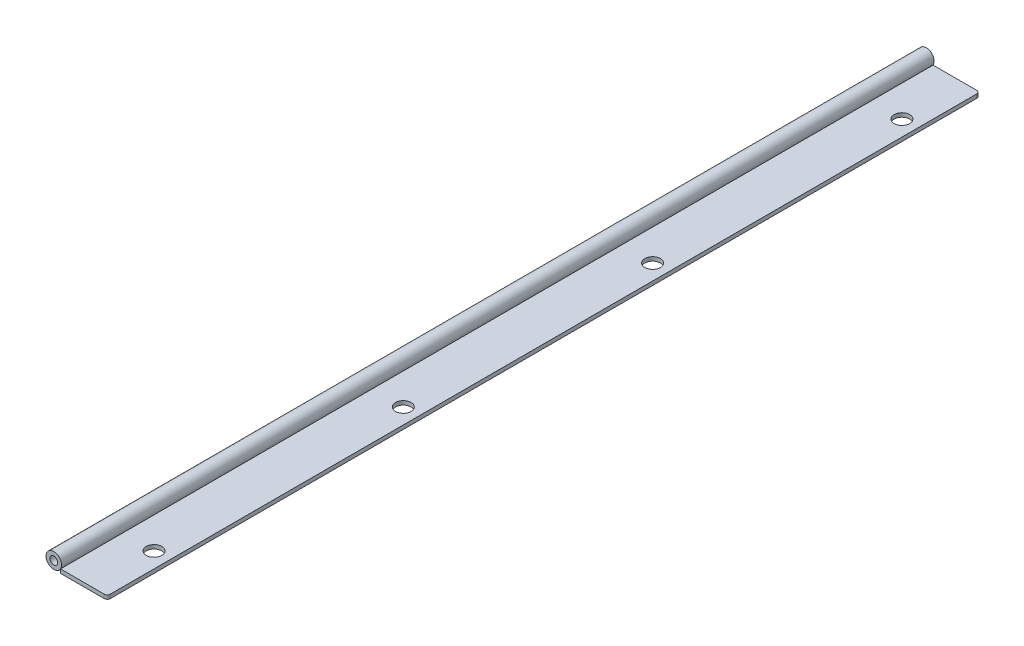
ISO-10303-21;
HEADER;
FILE_DESCRIPTION(('STEP AP214'),'2;1');
FILE_NAME('part.step','',(''),(''),'','','');
FILE_SCHEMA(('AUTOMOTIVE_DESIGN { 1 0 10303 214 1 1 1 1 }'));
ENDSEC;
DATA;
#1=APPLICATION_CONTEXT('core data for automotive mechanical design processes');
#2=APPLICATION_PROTOCOL_DEFINITION('international standard','automotive_design',2000,#1);
#3=PRODUCT_CONTEXT('',#1,'mechanical');
#4=PRODUCT('Part','Part','',(#3));
#5=PRODUCT_RELATED_PRODUCT_CATEGORY('part','',(#4));
#6=PRODUCT_DEFINITION_FORMATION('','',#4);
#7=PRODUCT_DEFINITION_CONTEXT('part definition',#1,'design');
#8=PRODUCT_DEFINITION('design','',#6,#7);
#9=PRODUCT_DEFINITION_SHAPE('','',#8);
#10=(LENGTH_UNIT() NAMED_UNIT(*) SI_UNIT(.MILLI.,.METRE.));
#11=(NAMED_UNIT(*) PLANE_ANGLE_UNIT() SI_UNIT($,.RADIAN.));
#12=(NAMED_UNIT(*) SI_UNIT($,.STERADIAN.) SOLID_ANGLE_UNIT());
#13=UNCERTAINTY_MEASURE_WITH_UNIT(LENGTH_MEASURE(1.E-05),#10,'distance_accuracy_value','');
#14=(GEOMETRIC_REPRESENTATION_CONTEXT(3) GLOBAL_UNCERTAINTY_ASSIGNED_CONTEXT((#13)) GLOBAL_UNIT_ASSIGNED_CONTEXT((#10,
#11,#12)) REPRESENTATION_CONTEXT('',''));
#15=CARTESIAN_POINT('',(0.,0.,0.));
#16=DIRECTION('',(0.,0.,1.));
#17=DIRECTION('',(1.,0.,0.));
#18=AXIS2_PLACEMENT_3D('',#15,#16,#17);
#19=CARTESIAN_POINT('',(-5.49926131403118,6.35,-711.2));
#20=DIRECTION('',(0.,0.,1.));
#21=DIRECTION('',(1.,0.,0.));
#22=AXIS2_PLACEMENT_3D('',#19,#20,#21);
#23=CYLINDRICAL_SURFACE('',#22,6.35);
#24=CARTESIAN_POINT('',(-5.49926131403118,6.35,-711.2));
#25=DIRECTION('',(0.,0.,1.));
#26=DIRECTION('',(1.,0.,0.));
#27=AXIS2_PLACEMENT_3D('',#24,#25,#26);
#28=CIRCLE('',#27,6.35);
#29=CARTESIAN_POINT('',(0.850738685968815,6.35,-711.2));
#30=VERTEX_POINT('',#29);
#31=EDGE_CURVE('E11',#30,#30,#28,.T.);
#32=ORIENTED_EDGE('',*,*,#31,.T.);
#33=EDGE_LOOP('',(#32));
#34=FACE_BOUND('',#33,.T.);
#35=CARTESIAN_POINT('',(-5.49926131403118,6.35,0.));
#36=DIRECTION('',(0.,0.,1.));
#37=DIRECTION('',(1.,0.,0.));
#38=AXIS2_PLACEMENT_3D('',#35,#36,#37);
#39=CIRCLE('',#38,6.35);
#40=CARTESIAN_POINT('',(0.850738685968815,6.35,0.));
#41=VERTEX_POINT('',#40);
#42=EDGE_CURVE('E46',#41,#41,#39,.T.);
#43=ORIENTED_EDGE('',*,*,#42,.F.);
#44=EDGE_LOOP('',(#43));
#45=FACE_BOUND('',#44,.T.);
#46=ADVANCED_FACE('F43',(#34,#45),#23,.T.);
#47=CARTESIAN_POINT('',(-5.49926131403118,6.35,-711.2));
#48=DIRECTION('',(0.,0.,1.));
#49=DIRECTION('',(1.,0.,0.));
#50=AXIS2_PLACEMENT_3D('',#47,#48,#49);
#51=PLANE('',#50);
#52=CARTESIAN_POINT('',(-5.49926131403118,6.35,-711.2));
#53=DIRECTION('',(0.,0.,1.));
#54=DIRECTION('',(1.,0.,0.));
#55=AXIS2_PLACEMENT_3D('',#52,#53,#54);
#56=CIRCLE('',#55,3.175);
#57=CARTESIAN_POINT('',(-2.32426131403118,6.35,-711.2));
#58=VERTEX_POINT('',#57);
#59=EDGE_CURVE('E53',#58,#58,#56,.T.);
#60=ORIENTED_EDGE('',*,*,#59,.T.);
#61=EDGE_LOOP('',(#60));
#62=FACE_BOUND('',#61,.T.);
#63=ORIENTED_EDGE('',*,*,#31,.F.);
#64=EDGE_LOOP('',(#63));
#65=FACE_BOUND('',#64,.T.);
#66=ADVANCED_FACE('F61',(#62,#65),#51,.F.);
#67=CARTESIAN_POINT('',(-5.49926131403118,6.35,0.));
#68=DIRECTION('',(0.,0.,1.));
#69=DIRECTION('',(1.,0.,0.));
#70=AXIS2_PLACEMENT_3D('',#67,#68,#69);
#71=PLANE('',#70);
#72=CARTESIAN_POINT('',(-5.49926131403118,6.35,0.));
#73=DIRECTION('',(0.,0.,1.));
#74=DIRECTION('',(1.,0.,0.));
#75=AXIS2_PLACEMENT_3D('',#72,#73,#74);
#76=CIRCLE('',#75,3.175);
#77=CARTESIAN_POINT('',(-2.32426131403118,6.35,0.));
#78=VERTEX_POINT('',#77);
#79=EDGE_CURVE('E55',#78,#78,#76,.T.);
#80=ORIENTED_EDGE('',*,*,#79,.F.);
#81=EDGE_LOOP('',(#80));
#82=FACE_BOUND('',#81,.T.);
#83=ORIENTED_EDGE('',*,*,#42,.T.);
#84=EDGE_LOOP('',(#83));
#85=FACE_BOUND('',#84,.T.);
#86=ADVANCED_FACE('F67',(#82,#85),#71,.T.);
#87=CARTESIAN_POINT('',(-5.49926131403118,6.35,-711.2));
#88=DIRECTION('',(0.,0.,1.));
#89=DIRECTION('',(1.,0.,0.));
#90=AXIS2_PLACEMENT_3D('',#87,#88,#89);
#91=CYLINDRICAL_SURFACE('',#90,3.175);
#92=ORIENTED_EDGE('',*,*,#59,.F.);
#93=EDGE_LOOP('',(#92));
#94=FACE_BOUND('',#93,.T.);
#95=ORIENTED_EDGE('',*,*,#79,.T.);
#96=EDGE_LOOP('',(#95));
#97=FACE_BOUND('',#96,.T.);
#98=ADVANCED_FACE('F64',(#94,#97),#91,.F.);
#99=CLOSED_SHELL('',(#46,#66,#86,#98));
#100=MANIFOLD_SOLID_BREP('B2',#99);
#101=CARTESIAN_POINT('',(0.,3.175,0.));
#102=DIRECTION('',(1.,0.,0.));
#103=DIRECTION('',(0.,0.,-1.));
#104=AXIS2_PLACEMENT_3D('',#101,#102,#103);
#105=PLANE('',#104);
#106=DIRECTION('',(0.,0.,1.));
#107=VECTOR('',#106,1.);
#108=CARTESIAN_POINT('',(0.,0.,0.));
#109=LINE('',#108,#107);
#110=CARTESIAN_POINT('',(-1.31838984174237E-13,0.,-711.2));
#111=VERTEX_POINT('',#110);
#112=CARTESIAN_POINT('',(0.,0.,0.));
#113=VERTEX_POINT('',#112);
#114=EDGE_CURVE('E177',#111,#113,#109,.T.);
#115=ORIENTED_EDGE('',*,*,#114,.T.);
#116=DIRECTION('',(0.,-1.,0.));
#117=VECTOR('',#116,1.);
#118=CARTESIAN_POINT('',(0.,3.175,0.));
#119=LINE('',#118,#117);
#120=CARTESIAN_POINT('',(0.,3.175,0.));
#121=VERTEX_POINT('',#120);
#122=EDGE_CURVE('E162',#121,#113,#119,.T.);
#123=ORIENTED_EDGE('',*,*,#122,.F.);
#124=DIRECTION('',(0.,0.,1.));
#125=VECTOR('',#124,1.);
#126=CARTESIAN_POINT('',(0.,3.175,0.));
#127=LINE('',#126,#125);
#128=CARTESIAN_POINT('',(-1.31838984174237E-13,3.175,-711.2));
#129=VERTEX_POINT('',#128);
#130=EDGE_CURVE('E166',#129,#121,#127,.T.);
#131=ORIENTED_EDGE('',*,*,#130,.F.);
#132=DIRECTION('',(0.,-1.,0.));
#133=VECTOR('',#132,1.);
#134=CARTESIAN_POINT('',(-1.31838984174237E-13,3.175,-711.2));
#135=LINE('',#134,#133);
#136=EDGE_CURVE('E179',#129,#111,#135,.T.);
#137=ORIENTED_EDGE('',*,*,#136,.T.);
#138=EDGE_LOOP('',(#115,#123,#131,#137));
#139=FACE_BOUND('',#138,.T.);
#140=ADVANCED_FACE('F105',(#139),#105,.F.);
#141=CARTESIAN_POINT('',(0.,3.175,0.));
#142=DIRECTION('',(0.,0.,-1.));
#143=DIRECTION('',(-1.,0.,0.));
#144=AXIS2_PLACEMENT_3D('',#141,#142,#143);
#145=PLANE('',#144);
#146=DIRECTION('',(1.,0.,0.));
#147=VECTOR('',#146,1.);
#148=CARTESIAN_POINT('',(0.,0.,0.));
#149=LINE('',#148,#147);
#150=CARTESIAN_POINT('',(35.56,0.,0.));
#151=VERTEX_POINT('',#150);
#152=EDGE_CURVE('E205',#113,#151,#149,.T.);
#153=ORIENTED_EDGE('',*,*,#152,.T.);
#154=DIRECTION('',(0.,-1.,0.));
#155=VECTOR('',#154,1.);
#156=CARTESIAN_POINT('',(35.56,3.175,0.));
#157=LINE('',#156,#155);
#158=CARTESIAN_POINT('',(35.56,3.175,0.));
#159=VERTEX_POINT('',#158);
#160=EDGE_CURVE('E128',#151,#159,#157,.F.);
#161=ORIENTED_EDGE('',*,*,#160,.T.);
#162=DIRECTION('',(1.,0.,0.));
#163=VECTOR('',#162,1.);
#164=CARTESIAN_POINT('',(0.,3.175,0.));
#165=LINE('',#164,#163);
#166=EDGE_CURVE('E158',#121,#159,#165,.T.);
#167=ORIENTED_EDGE('',*,*,#166,.F.);
#168=ORIENTED_EDGE('',*,*,#122,.T.);
#169=EDGE_LOOP('',(#153,#161,#167,#168));
#170=FACE_BOUND('',#169,.T.);
#171=ADVANCED_FACE('F160',(#170),#145,.F.);
#172=CARTESIAN_POINT('',(38.1,3.175,0.));
#173=DIRECTION('',(-1.,0.,0.));
#174=DIRECTION('',(0.,0.,1.));
#175=AXIS2_PLACEMENT_3D('',#172,#173,#174);
#176=PLANE('',#175);
#177=DIRECTION('',(0.,0.,-1.));
#178=VECTOR('',#177,1.);
#179=CARTESIAN_POINT('',(38.1,3.175,0.));
#180=LINE('',#179,#178);
#181=CARTESIAN_POINT('',(38.1,3.175,-2.54));
#182=VERTEX_POINT('',#181);
#183=CARTESIAN_POINT('',(38.0999999999999,3.175,-708.66));
#184=VERTEX_POINT('',#183);
#185=EDGE_CURVE('E165',#182,#184,#180,.T.);
#186=ORIENTED_EDGE('',*,*,#185,.F.);
#187=DIRECTION('',(0.,-1.,0.));
#188=VECTOR('',#187,1.);
#189=CARTESIAN_POINT('',(38.1,3.175,-2.54));
#190=LINE('',#189,#188);
#191=CARTESIAN_POINT('',(38.1,0.,-2.54));
#192=VERTEX_POINT('',#191);
#193=EDGE_CURVE('E181',#182,#192,#190,.T.);
#194=ORIENTED_EDGE('',*,*,#193,.T.);
#195=DIRECTION('',(0.,0.,-1.));
#196=VECTOR('',#195,1.);
#197=CARTESIAN_POINT('',(38.1,0.,0.));
#198=LINE('',#197,#196);
#199=CARTESIAN_POINT('',(38.0999999999999,0.,-708.66));
#200=VERTEX_POINT('',#199);
#201=EDGE_CURVE('E206',#192,#200,#198,.T.);
#202=ORIENTED_EDGE('',*,*,#201,.T.);
#203=DIRECTION('',(0.,-1.,0.));
#204=VECTOR('',#203,1.);
#205=CARTESIAN_POINT('',(38.0999999999999,3.175,-708.66));
#206=LINE('',#205,#204);
#207=EDGE_CURVE('E178',#200,#184,#206,.F.);
#208=ORIENTED_EDGE('',*,*,#207,.T.);
#209=EDGE_LOOP('',(#186,#194,#202,#208));
#210=FACE_BOUND('',#209,.T.);
#211=ADVANCED_FACE('F197',(#210),#176,.F.);
#212=CARTESIAN_POINT('',(-1.31838984174237E-13,3.175,-711.2));
#213=DIRECTION('',(0.,0.,1.));
#214=DIRECTION('',(1.,0.,0.));
#215=AXIS2_PLACEMENT_3D('',#212,#213,#214);
#216=PLANE('',#215);
#217=DIRECTION('',(-1.,0.,0.));
#218=VECTOR('',#217,1.);
#219=CARTESIAN_POINT('',(-1.31838984174237E-13,3.175,-711.2));
#220=LINE('',#219,#218);
#221=CARTESIAN_POINT('',(35.5599999999999,3.175,-711.2));
#222=VERTEX_POINT('',#221);
#223=EDGE_CURVE('E170',#222,#129,#220,.T.);
#224=ORIENTED_EDGE('',*,*,#223,.F.);
#225=DIRECTION('',(0.,-1.,0.));
#226=VECTOR('',#225,1.);
#227=CARTESIAN_POINT('',(35.5599999999999,3.175,-711.2));
#228=LINE('',#227,#226);
#229=CARTESIAN_POINT('',(35.5599999999999,0.,-711.2));
#230=VERTEX_POINT('',#229);
#231=EDGE_CURVE('E41',#222,#230,#228,.T.);
#232=ORIENTED_EDGE('',*,*,#231,.T.);
#233=DIRECTION('',(-1.,0.,0.));
#234=VECTOR('',#233,1.);
#235=CARTESIAN_POINT('',(-1.31838984174237E-13,0.,-711.2));
#236=LINE('',#235,#234);
#237=EDGE_CURVE('E174',#230,#111,#236,.T.);
#238=ORIENTED_EDGE('',*,*,#237,.T.);
#239=ORIENTED_EDGE('',*,*,#136,.F.);
#240=EDGE_LOOP('',(#224,#232,#238,#239));
#241=FACE_BOUND('',#240,.T.);
#242=ADVANCED_FACE('F214',(#241),#216,.F.);
#243=CARTESIAN_POINT('',(-1.31838984174237E-13,3.175,-711.2));
#244=DIRECTION('',(0.,-1.,0.));
#245=DIRECTION('',(0.,0.,-1.));
#246=AXIS2_PLACEMENT_3D('',#243,#244,#245);
#247=PLANE('',#246);
#248=CARTESIAN_POINT('',(25.3999999999999,3.175,-50.8));
#249=DIRECTION('',(0.,-1.,0.));
#250=DIRECTION('',(0.,0.,-1.));
#251=AXIS2_PLACEMENT_3D('',#248,#249,#250);
#252=CIRCLE('',#251,6.35);
#253=CARTESIAN_POINT('',(25.3999999999999,3.175,-57.15));
#254=VERTEX_POINT('',#253);
#255=EDGE_CURVE('E261',#254,#254,#252,.T.);
#256=ORIENTED_EDGE('',*,*,#255,.T.);
#257=EDGE_LOOP('',(#256));
#258=FACE_BOUND('',#257,.T.);
#259=CARTESIAN_POINT('',(25.3999999999999,3.175,-254.));
#260=DIRECTION('',(0.,-1.,0.));
#261=DIRECTION('',(0.,0.,-1.));
#262=AXIS2_PLACEMENT_3D('',#259,#260,#261);
#263=CIRCLE('',#262,6.35);
#264=CARTESIAN_POINT('',(25.3999999999999,3.175,-260.35));
#265=VERTEX_POINT('',#264);
#266=EDGE_CURVE('E265',#265,#265,#263,.T.);
#267=ORIENTED_EDGE('',*,*,#266,.T.);
#268=EDGE_LOOP('',(#267));
#269=FACE_BOUND('',#268,.T.);
#270=CARTESIAN_POINT('',(25.3999999999999,3.175,-457.2));
#271=DIRECTION('',(0.,-1.,0.));
#272=DIRECTION('',(0.,0.,-1.));
#273=AXIS2_PLACEMENT_3D('',#270,#271,#272);
#274=CIRCLE('',#273,6.35);
#275=CARTESIAN_POINT('',(25.3999999999999,3.175,-463.55));
#276=VERTEX_POINT('',#275);
#277=EDGE_CURVE('E274',#276,#276,#274,.T.);
#278=ORIENTED_EDGE('',*,*,#277,.T.);
#279=EDGE_LOOP('',(#278));
#280=FACE_BOUND('',#279,.T.);
#281=CARTESIAN_POINT('',(25.3999999999999,3.175,-660.4));
#282=DIRECTION('',(0.,-1.,0.));
#283=DIRECTION('',(0.,0.,-1.));
#284=AXIS2_PLACEMENT_3D('',#281,#282,#283);
#285=CIRCLE('',#284,6.35);
#286=CARTESIAN_POINT('',(25.3999999999999,3.175,-666.75));
#287=VERTEX_POINT('',#286);
#288=EDGE_CURVE('E209',#287,#287,#285,.T.);
#289=ORIENTED_EDGE('',*,*,#288,.T.);
#290=EDGE_LOOP('',(#289));
#291=FACE_BOUND('',#290,.T.);
#292=ORIENTED_EDGE('',*,*,#166,.T.);
#293=CARTESIAN_POINT('',(35.56,3.175,-2.54));
#294=DIRECTION('',(0.,-1.,0.));
#295=DIRECTION('',(0.,0.,-1.));
#296=AXIS2_PLACEMENT_3D('',#293,#294,#295);
#297=CIRCLE('',#296,2.54);
#298=EDGE_CURVE('E113',#159,#182,#297,.F.);
#299=ORIENTED_EDGE('',*,*,#298,.T.);
#300=ORIENTED_EDGE('',*,*,#185,.T.);
#301=CARTESIAN_POINT('',(35.5599999999999,3.175,-708.66));
#302=DIRECTION('',(0.,-1.,0.));
#303=DIRECTION('',(0.,0.,-1.));
#304=AXIS2_PLACEMENT_3D('',#301,#302,#303);
#305=CIRCLE('',#304,2.54);
#306=EDGE_CURVE('E120',#184,#222,#305,.F.);
#307=ORIENTED_EDGE('',*,*,#306,.T.);
#308=ORIENTED_EDGE('',*,*,#223,.T.);
#309=ORIENTED_EDGE('',*,*,#130,.T.);
#310=EDGE_LOOP('',(#292,#299,#300,#307,#308,#309));
#311=FACE_BOUND('',#310,.T.);
#312=ADVANCED_FACE('F169',(#258,#269,#280,#291,#311),#247,.F.);
#313=CARTESIAN_POINT('',(-1.31838984174237E-13,0.,-711.2));
#314=DIRECTION('',(0.,-1.,0.));
#315=DIRECTION('',(0.,0.,-1.));
#316=AXIS2_PLACEMENT_3D('',#313,#314,#315);
#317=PLANE('',#316);
#318=CARTESIAN_POINT('',(25.3999999999999,0.,-50.8));
#319=DIRECTION('',(0.,-1.,0.));
#320=DIRECTION('',(0.,0.,-1.));
#321=AXIS2_PLACEMENT_3D('',#318,#319,#320);
#322=CIRCLE('',#321,6.35);
#323=CARTESIAN_POINT('',(25.3999999999999,0.,-57.15));
#324=VERTEX_POINT('',#323);
#325=EDGE_CURVE('E258',#324,#324,#322,.T.);
#326=ORIENTED_EDGE('',*,*,#325,.F.);
#327=EDGE_LOOP('',(#326));
#328=FACE_BOUND('',#327,.T.);
#329=CARTESIAN_POINT('',(25.3999999999999,0.,-254.));
#330=DIRECTION('',(0.,-1.,0.));
#331=DIRECTION('',(0.,0.,-1.));
#332=AXIS2_PLACEMENT_3D('',#329,#330,#331);
#333=CIRCLE('',#332,6.35);
#334=CARTESIAN_POINT('',(25.3999999999999,0.,-260.35));
#335=VERTEX_POINT('',#334);
#336=EDGE_CURVE('E262',#335,#335,#333,.T.);
#337=ORIENTED_EDGE('',*,*,#336,.F.);
#338=EDGE_LOOP('',(#337));
#339=FACE_BOUND('',#338,.T.);
#340=CARTESIAN_POINT('',(25.3999999999999,0.,-457.2));
#341=DIRECTION('',(0.,-1.,0.));
#342=DIRECTION('',(0.,0.,-1.));
#343=AXIS2_PLACEMENT_3D('',#340,#341,#342);
#344=CIRCLE('',#343,6.35);
#345=CARTESIAN_POINT('',(25.3999999999999,0.,-463.55));
#346=VERTEX_POINT('',#345);
#347=EDGE_CURVE('E271',#346,#346,#344,.T.);
#348=ORIENTED_EDGE('',*,*,#347,.F.);
#349=EDGE_LOOP('',(#348));
#350=FACE_BOUND('',#349,.T.);
#351=CARTESIAN_POINT('',(25.3999999999999,0.,-660.4));
#352=DIRECTION('',(0.,-1.,0.));
#353=DIRECTION('',(0.,0.,-1.));
#354=AXIS2_PLACEMENT_3D('',#351,#352,#353);
#355=CIRCLE('',#354,6.35);
#356=CARTESIAN_POINT('',(25.3999999999999,0.,-666.75));
#357=VERTEX_POINT('',#356);
#358=EDGE_CURVE('E277',#357,#357,#355,.T.);
#359=ORIENTED_EDGE('',*,*,#358,.F.);
#360=EDGE_LOOP('',(#359));
#361=FACE_BOUND('',#360,.T.);
#362=ORIENTED_EDGE('',*,*,#201,.F.);
#363=CARTESIAN_POINT('',(35.56,0.,-2.54));
#364=DIRECTION('',(0.,-1.,0.));
#365=DIRECTION('',(0.,0.,-1.));
#366=AXIS2_PLACEMENT_3D('',#363,#364,#365);
#367=CIRCLE('',#366,2.54);
#368=EDGE_CURVE('E190',#192,#151,#367,.T.);
#369=ORIENTED_EDGE('',*,*,#368,.T.);
#370=ORIENTED_EDGE('',*,*,#152,.F.);
#371=ORIENTED_EDGE('',*,*,#114,.F.);
#372=ORIENTED_EDGE('',*,*,#237,.F.);
#373=CARTESIAN_POINT('',(35.5599999999999,0.,-708.66));
#374=DIRECTION('',(0.,-1.,0.));
#375=DIRECTION('',(0.,0.,-1.));
#376=AXIS2_PLACEMENT_3D('',#373,#374,#375);
#377=CIRCLE('',#376,2.54);
#378=EDGE_CURVE('E188',#230,#200,#377,.T.);
#379=ORIENTED_EDGE('',*,*,#378,.T.);
#380=EDGE_LOOP('',(#362,#369,#370,#371,#372,#379));
#381=FACE_BOUND('',#380,.T.);
#382=ADVANCED_FACE('F204',(#328,#339,#350,#361,#381),#317,.T.);
#383=CARTESIAN_POINT('',(35.56,3.175,-2.54));
#384=DIRECTION('',(0.,-1.,0.));
#385=DIRECTION('',(0.,0.,-1.));
#386=AXIS2_PLACEMENT_3D('',#383,#384,#385);
#387=CYLINDRICAL_SURFACE('',#386,2.54);
#388=ORIENTED_EDGE('',*,*,#298,.F.);
#389=ORIENTED_EDGE('',*,*,#160,.F.);
#390=ORIENTED_EDGE('',*,*,#368,.F.);
#391=ORIENTED_EDGE('',*,*,#193,.F.);
#392=EDGE_LOOP('',(#388,#389,#390,#391));
#393=FACE_BOUND('',#392,.T.);
#394=ADVANCED_FACE('F202',(#393),#387,.T.);
#395=CARTESIAN_POINT('',(35.5599999999999,3.175,-708.66));
#396=DIRECTION('',(0.,-1.,0.));
#397=DIRECTION('',(0.,0.,-1.));
#398=AXIS2_PLACEMENT_3D('',#395,#396,#397);
#399=CYLINDRICAL_SURFACE('',#398,2.54);
#400=ORIENTED_EDGE('',*,*,#306,.F.);
#401=ORIENTED_EDGE('',*,*,#207,.F.);
#402=ORIENTED_EDGE('',*,*,#378,.F.);
#403=ORIENTED_EDGE('',*,*,#231,.F.);
#404=EDGE_LOOP('',(#400,#401,#402,#403));
#405=FACE_BOUND('',#404,.T.);
#406=ADVANCED_FACE('F107',(#405),#399,.T.);
#407=CARTESIAN_POINT('',(25.3999999999999,12.7,-660.4));
#408=DIRECTION('',(0.,-1.,0.));
#409=DIRECTION('',(0.,0.,-1.));
#410=AXIS2_PLACEMENT_3D('',#407,#408,#409);
#411=CYLINDRICAL_SURFACE('',#410,6.35);
#412=ORIENTED_EDGE('',*,*,#358,.T.);
#413=EDGE_LOOP('',(#412));
#414=FACE_BOUND('',#413,.T.);
#415=ORIENTED_EDGE('',*,*,#288,.F.);
#416=EDGE_LOOP('',(#415));
#417=FACE_BOUND('',#416,.T.);
#418=ADVANCED_FACE('F218',(#414,#417),#411,.F.);
#419=CARTESIAN_POINT('',(25.3999999999999,12.7,-457.2));
#420=DIRECTION('',(0.,-1.,0.));
#421=DIRECTION('',(0.,0.,-1.));
#422=AXIS2_PLACEMENT_3D('',#419,#420,#421);
#423=CYLINDRICAL_SURFACE('',#422,6.35);
#424=ORIENTED_EDGE('',*,*,#347,.T.);
#425=EDGE_LOOP('',(#424));
#426=FACE_BOUND('',#425,.T.);
#427=ORIENTED_EDGE('',*,*,#277,.F.);
#428=EDGE_LOOP('',(#427));
#429=FACE_BOUND('',#428,.T.);
#430=ADVANCED_FACE('F223',(#426,#429),#423,.F.);
#431=CARTESIAN_POINT('',(25.3999999999999,12.7,-254.));
#432=DIRECTION('',(0.,-1.,0.));
#433=DIRECTION('',(0.,0.,-1.));
#434=AXIS2_PLACEMENT_3D('',#431,#432,#433);
#435=CYLINDRICAL_SURFACE('',#434,6.35);
#436=ORIENTED_EDGE('',*,*,#336,.T.);
#437=EDGE_LOOP('',(#436));
#438=FACE_BOUND('',#437,.T.);
#439=ORIENTED_EDGE('',*,*,#266,.F.);
#440=EDGE_LOOP('',(#439));
#441=FACE_BOUND('',#440,.T.);
#442=ADVANCED_FACE('F245',(#438,#441),#435,.F.);
#443=CARTESIAN_POINT('',(25.3999999999999,12.7,-50.8));
#444=DIRECTION('',(0.,-1.,0.));
#445=DIRECTION('',(0.,0.,-1.));
#446=AXIS2_PLACEMENT_3D('',#443,#444,#445);
#447=CYLINDRICAL_SURFACE('',#446,6.35);
#448=ORIENTED_EDGE('',*,*,#325,.T.);
#449=EDGE_LOOP('',(#448));
#450=FACE_BOUND('',#449,.T.);
#451=ORIENTED_EDGE('',*,*,#255,.F.);
#452=EDGE_LOOP('',(#451));
#453=FACE_BOUND('',#452,.T.);
#454=ADVANCED_FACE('F249',(#450,#453),#447,.F.);
#455=CLOSED_SHELL('',(#140,#171,#211,#242,#312,#382,#394,#406,#418,#430,#442,#454));
#456=MANIFOLD_SOLID_BREP('B6',#455);
#457=ADVANCED_BREP_SHAPE_REPRESENTATION('',(#18,#100,#456),#14);
#458=SHAPE_DEFINITION_REPRESENTATION(#9,#457);
ENDSEC;
END-ISO-10303-21;
